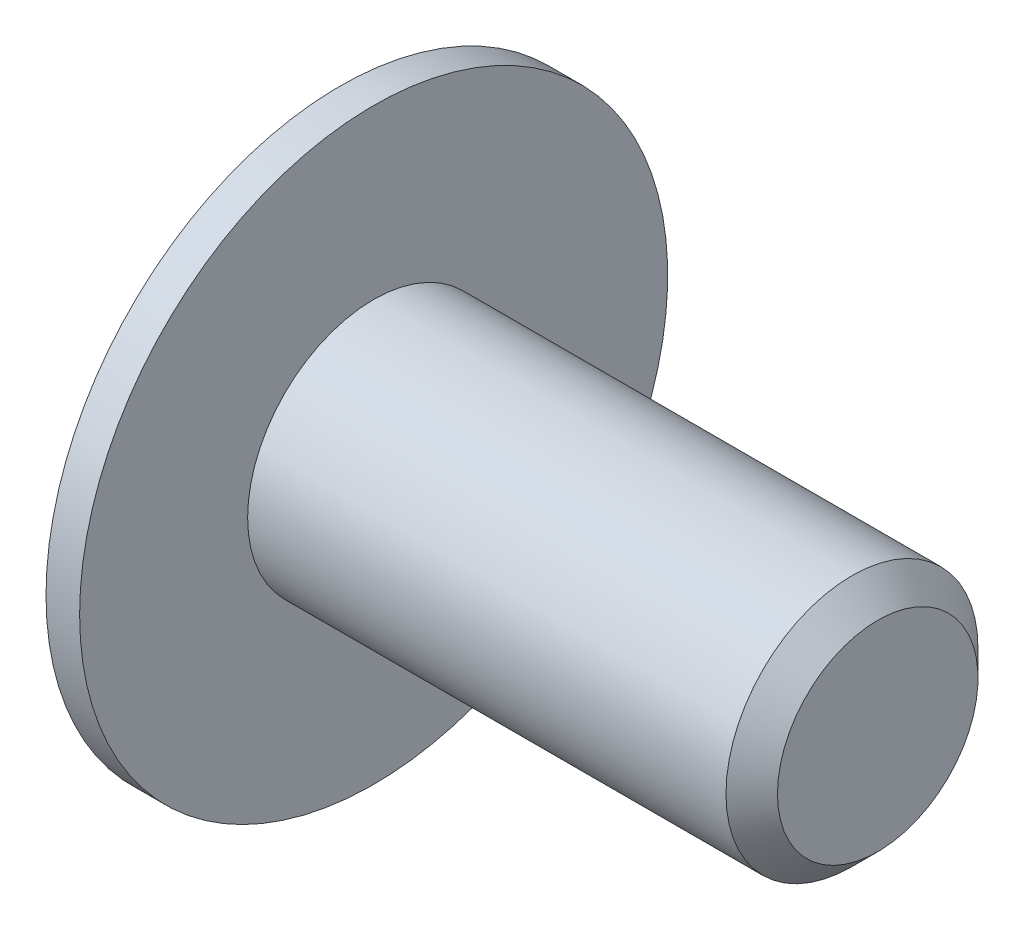
ISO-10303-21;
HEADER;
FILE_DESCRIPTION(('STEP AP214'),'2;1');
FILE_NAME('part.step','',(''),(''),'','','');
FILE_SCHEMA(('AUTOMOTIVE_DESIGN { 1 0 10303 214 1 1 1 1 }'));
ENDSEC;
DATA;
#1=APPLICATION_CONTEXT('core data for automotive mechanical design processes');
#2=APPLICATION_PROTOCOL_DEFINITION('international standard','automotive_design',2000,#1);
#3=PRODUCT_CONTEXT('',#1,'mechanical');
#4=PRODUCT('Part','Part','',(#3));
#5=PRODUCT_RELATED_PRODUCT_CATEGORY('part','',(#4));
#6=PRODUCT_DEFINITION_FORMATION('','',#4);
#7=PRODUCT_DEFINITION_CONTEXT('part definition',#1,'design');
#8=PRODUCT_DEFINITION('design','',#6,#7);
#9=PRODUCT_DEFINITION_SHAPE('','',#8);
#10=(LENGTH_UNIT() NAMED_UNIT(*) SI_UNIT(.MILLI.,.METRE.));
#11=(NAMED_UNIT(*) PLANE_ANGLE_UNIT() SI_UNIT($,.RADIAN.));
#12=(NAMED_UNIT(*) SI_UNIT($,.STERADIAN.) SOLID_ANGLE_UNIT());
#13=UNCERTAINTY_MEASURE_WITH_UNIT(LENGTH_MEASURE(1.E-05),#10,'distance_accuracy_value','');
#14=(GEOMETRIC_REPRESENTATION_CONTEXT(3) GLOBAL_UNCERTAINTY_ASSIGNED_CONTEXT((#13)) GLOBAL_UNIT_ASSIGNED_CONTEXT((#10,
#11,#12)) REPRESENTATION_CONTEXT('',''));
#15=CARTESIAN_POINT('',(0.,0.,0.));
#16=DIRECTION('',(0.,0.,1.));
#17=DIRECTION('',(1.,0.,0.));
#18=AXIS2_PLACEMENT_3D('',#15,#16,#17);
#19=CARTESIAN_POINT('',(-0.8,0.,0.));
#20=DIRECTION('',(1.,0.,0.));
#21=DIRECTION('',(0.,0.,-1.));
#22=AXIS2_PLACEMENT_3D('',#19,#20,#21);
#23=PLANE('',#22);
#24=CARTESIAN_POINT('',(-0.8,0.,0.));
#25=DIRECTION('',(-1.,0.,0.));
#26=DIRECTION('',(0.,0.,1.));
#27=AXIS2_PLACEMENT_3D('',#24,#25,#26);
#28=CIRCLE('',#27,2.8);
#29=CARTESIAN_POINT('',(-0.8,0.,2.8));
#30=VERTEX_POINT('',#29);
#31=EDGE_CURVE('E11',#30,#30,#28,.T.);
#32=ORIENTED_EDGE('',*,*,#31,.T.);
#33=EDGE_LOOP('',(#32));
#34=FACE_BOUND('',#33,.T.);
#35=DIRECTION('',(0.,0.,1.));
#36=VECTOR('',#35,1.);
#37=CARTESIAN_POINT('',(-0.8,0.23333335666667,0.46666669));
#38=LINE('',#37,#36);
#39=CARTESIAN_POINT('',(-0.8,0.23333335666667,0.46666669));
#40=VERTEX_POINT('',#39);
#41=CARTESIAN_POINT('',(-0.8,0.23333335666667,1.1666666666667));
#42=VERTEX_POINT('',#41);
#43=EDGE_CURVE('E51',#40,#42,#38,.T.);
#44=ORIENTED_EDGE('',*,*,#43,.T.);
#45=DIRECTION('',(0.,-1.,0.));
#46=VECTOR('',#45,1.);
#47=CARTESIAN_POINT('',(-0.8,0.23333335666667,1.1666666666667));
#48=LINE('',#47,#46);
#49=CARTESIAN_POINT('',(-0.8,-0.23333333333333,1.1666666666667));
#50=VERTEX_POINT('',#49);
#51=EDGE_CURVE('E183',#42,#50,#48,.T.);
#52=ORIENTED_EDGE('',*,*,#51,.T.);
#53=DIRECTION('',(0.,0.,-1.));
#54=VECTOR('',#53,1.);
#55=CARTESIAN_POINT('',(-0.8,-0.23333333333333,1.1666666666667));
#56=LINE('',#55,#54);
#57=CARTESIAN_POINT('',(-0.8,-0.23333333333333,0.46666669));
#58=VERTEX_POINT('',#57);
#59=EDGE_CURVE('E186',#50,#58,#56,.T.);
#60=ORIENTED_EDGE('',*,*,#59,.T.);
#61=CARTESIAN_POINT('',(-0.8,-0.466666666666673,0.466666690000013));
#62=DIRECTION('',(-1.,0.,0.));
#63=DIRECTION('',(0.,0.,1.));
#64=AXIS2_PLACEMENT_3D('',#61,#62,#63);
#65=CIRCLE('',#64,0.233333333333343);
#66=CARTESIAN_POINT('',(-0.8,-0.46666666666667,0.23333335666667));
#67=VERTEX_POINT('',#66);
#68=EDGE_CURVE('E189',#58,#67,#65,.T.);
#69=ORIENTED_EDGE('',*,*,#68,.T.);
#70=DIRECTION('',(0.,-1.,0.));
#71=VECTOR('',#70,1.);
#72=CARTESIAN_POINT('',(-0.8,-0.46666666666667,0.23333335666667));
#73=LINE('',#72,#71);
#74=CARTESIAN_POINT('',(-0.8,-1.1666666666667,0.23333335666667));
#75=VERTEX_POINT('',#74);
#76=EDGE_CURVE('E192',#67,#75,#73,.T.);
#77=ORIENTED_EDGE('',*,*,#76,.T.);
#78=DIRECTION('',(0.,0.,-1.));
#79=VECTOR('',#78,1.);
#80=CARTESIAN_POINT('',(-0.8,-1.1666666666667,0.23333335666667));
#81=LINE('',#80,#79);
#82=CARTESIAN_POINT('',(-0.8,-1.1666666666667,-0.23333333333333));
#83=VERTEX_POINT('',#82);
#84=EDGE_CURVE('E195',#75,#83,#81,.T.);
#85=ORIENTED_EDGE('',*,*,#84,.T.);
#86=DIRECTION('',(0.,1.,0.));
#87=VECTOR('',#86,1.);
#88=CARTESIAN_POINT('',(-0.8,-1.1666666666667,-0.23333333333333));
#89=LINE('',#88,#87);
#90=CARTESIAN_POINT('',(-0.8,-0.46666666666667,-0.23333333333333));
#91=VERTEX_POINT('',#90);
#92=EDGE_CURVE('E198',#83,#91,#89,.T.);
#93=ORIENTED_EDGE('',*,*,#92,.T.);
#94=CARTESIAN_POINT('',(-0.8,-0.46666666666669,-0.46666666666669));
#95=DIRECTION('',(-1.,0.,0.));
#96=DIRECTION('',(0.,0.,1.));
#97=AXIS2_PLACEMENT_3D('',#94,#95,#96);
#98=CIRCLE('',#97,0.23333333333336);
#99=CARTESIAN_POINT('',(-0.8,-0.23333333333333,-0.46666666666667));
#100=VERTEX_POINT('',#99);
#101=EDGE_CURVE('E201',#91,#100,#98,.T.);
#102=ORIENTED_EDGE('',*,*,#101,.T.);
#103=DIRECTION('',(0.,0.,-1.));
#104=VECTOR('',#103,1.);
#105=CARTESIAN_POINT('',(-0.8,-0.23333333333333,-0.46666666666667));
#106=LINE('',#105,#104);
#107=CARTESIAN_POINT('',(-0.8,-0.23333333333333,-1.1666666666667));
#108=VERTEX_POINT('',#107);
#109=EDGE_CURVE('E204',#100,#108,#106,.T.);
#110=ORIENTED_EDGE('',*,*,#109,.T.);
#111=DIRECTION('',(0.,1.,0.));
#112=VECTOR('',#111,1.);
#113=CARTESIAN_POINT('',(-0.8,-0.23333333333333,-1.1666666666667));
#114=LINE('',#113,#112);
#115=CARTESIAN_POINT('',(-0.8,0.23333335666667,-1.1666666666667));
#116=VERTEX_POINT('',#115);
#117=EDGE_CURVE('E207',#108,#116,#114,.T.);
#118=ORIENTED_EDGE('',*,*,#117,.T.);
#119=DIRECTION('',(0.,0.,1.));
#120=VECTOR('',#119,1.);
#121=CARTESIAN_POINT('',(-0.8,0.23333335666667,-1.1666666666667));
#122=LINE('',#121,#120);
#123=CARTESIAN_POINT('',(-0.8,0.23333335666667,-0.46666666666667));
#124=VERTEX_POINT('',#123);
#125=EDGE_CURVE('E210',#116,#124,#122,.T.);
#126=ORIENTED_EDGE('',*,*,#125,.T.);
#127=CARTESIAN_POINT('',(-0.8,0.466666690000013,-0.466666666666673));
#128=DIRECTION('',(-1.,0.,0.));
#129=DIRECTION('',(0.,0.,1.));
#130=AXIS2_PLACEMENT_3D('',#127,#128,#129);
#131=CIRCLE('',#130,0.233333333333343);
#132=CARTESIAN_POINT('',(-0.8,0.466666690000013,-0.23333333333333));
#133=VERTEX_POINT('',#132);
#134=EDGE_CURVE('E213',#124,#133,#131,.T.);
#135=ORIENTED_EDGE('',*,*,#134,.T.);
#136=DIRECTION('',(0.,1.,0.));
#137=VECTOR('',#136,1.);
#138=CARTESIAN_POINT('',(-0.8,0.46666669,-0.23333333333333));
#139=LINE('',#138,#137);
#140=CARTESIAN_POINT('',(-0.8,1.1666666666667,-0.23333333333333));
#141=VERTEX_POINT('',#140);
#142=EDGE_CURVE('E216',#133,#141,#139,.T.);
#143=ORIENTED_EDGE('',*,*,#142,.T.);
#144=DIRECTION('',(0.,0.,1.));
#145=VECTOR('',#144,1.);
#146=CARTESIAN_POINT('',(-0.8,1.1666666666667,-0.23333333333333));
#147=LINE('',#146,#145);
#148=CARTESIAN_POINT('',(-0.8,1.1666666666667,0.23333335666667));
#149=VERTEX_POINT('',#148);
#150=EDGE_CURVE('E219',#141,#149,#147,.T.);
#151=ORIENTED_EDGE('',*,*,#150,.T.);
#152=DIRECTION('',(0.,-1.,0.));
#153=VECTOR('',#152,1.);
#154=CARTESIAN_POINT('',(-0.8,1.1666666666667,0.23333335666667));
#155=LINE('',#154,#153);
#156=CARTESIAN_POINT('',(-0.8,0.46666669,0.23333335666667));
#157=VERTEX_POINT('',#156);
#158=EDGE_CURVE('E173',#149,#157,#155,.T.);
#159=ORIENTED_EDGE('',*,*,#158,.T.);
#160=CARTESIAN_POINT('',(-0.8,0.466666689999996,0.466666689999996));
#161=DIRECTION('',(-1.,0.,0.));
#162=DIRECTION('',(0.,0.,1.));
#163=AXIS2_PLACEMENT_3D('',#160,#161,#162);
#164=CIRCLE('',#163,0.233333333333326);
#165=EDGE_CURVE('E222',#157,#40,#164,.T.);
#166=ORIENTED_EDGE('',*,*,#165,.T.);
#167=EDGE_LOOP('',(#44,#52,#60,#69,#77,#85,#93,#102,#110,#118,#126,#135,#143,#151,#159,#166));
#168=FACE_BOUND('',#167,.T.);
#169=ADVANCED_FACE('F37',(#34,#168),#23,.F.);
#170=CARTESIAN_POINT('',(-0.4,0.,0.));
#171=DIRECTION('',(1.,0.,0.));
#172=DIRECTION('',(0.,0.,-1.));
#173=AXIS2_PLACEMENT_3D('',#170,#171,#172);
#174=CONICAL_SURFACE('',#173,3.5,1.05165021254837);
#175=ORIENTED_EDGE('',*,*,#31,.F.);
#176=EDGE_LOOP('',(#175));
#177=FACE_BOUND('',#176,.T.);
#178=CARTESIAN_POINT('',(-0.4,0.,0.));
#179=DIRECTION('',(-1.,0.,0.));
#180=DIRECTION('',(0.,0.,1.));
#181=AXIS2_PLACEMENT_3D('',#178,#179,#180);
#182=CIRCLE('',#181,3.5);
#183=CARTESIAN_POINT('',(-0.4,0.,3.5));
#184=VERTEX_POINT('',#183);
#185=EDGE_CURVE('E44',#184,#184,#182,.T.);
#186=ORIENTED_EDGE('',*,*,#185,.T.);
#187=EDGE_LOOP('',(#186));
#188=FACE_BOUND('',#187,.T.);
#189=ADVANCED_FACE('F267',(#177,#188),#174,.T.);
#190=CARTESIAN_POINT('',(6.,0.,0.));
#191=DIRECTION('',(-1.,0.,0.));
#192=DIRECTION('',(0.,0.,1.));
#193=AXIS2_PLACEMENT_3D('',#190,#191,#192);
#194=CYLINDRICAL_SURFACE('',#193,3.5);
#195=ORIENTED_EDGE('',*,*,#185,.F.);
#196=EDGE_LOOP('',(#195));
#197=FACE_BOUND('',#196,.T.);
#198=CARTESIAN_POINT('',(0.,0.,0.));
#199=DIRECTION('',(-1.,0.,0.));
#200=DIRECTION('',(0.,0.,1.));
#201=AXIS2_PLACEMENT_3D('',#198,#199,#200);
#202=CIRCLE('',#201,3.5);
#203=CARTESIAN_POINT('',(0.,0.,3.5));
#204=VERTEX_POINT('',#203);
#205=EDGE_CURVE('E262',#204,#204,#202,.T.);
#206=ORIENTED_EDGE('',*,*,#205,.T.);
#207=EDGE_LOOP('',(#206));
#208=FACE_BOUND('',#207,.T.);
#209=ADVANCED_FACE('F269',(#197,#208),#194,.T.);
#210=CARTESIAN_POINT('',(0.,3.5,0.));
#211=DIRECTION('',(-1.,0.,0.));
#212=DIRECTION('',(0.,0.,1.));
#213=AXIS2_PLACEMENT_3D('',#210,#211,#212);
#214=PLANE('',#213);
#215=ORIENTED_EDGE('',*,*,#205,.F.);
#216=EDGE_LOOP('',(#215));
#217=FACE_BOUND('',#216,.T.);
#218=CARTESIAN_POINT('',(0.,0.,0.));
#219=DIRECTION('',(-1.,0.,0.));
#220=DIRECTION('',(0.,0.,1.));
#221=AXIS2_PLACEMENT_3D('',#218,#219,#220);
#222=CIRCLE('',#221,1.5);
#223=CARTESIAN_POINT('',(0.,0.,1.5));
#224=VERTEX_POINT('',#223);
#225=EDGE_CURVE('E259',#224,#224,#222,.T.);
#226=ORIENTED_EDGE('',*,*,#225,.T.);
#227=EDGE_LOOP('',(#226));
#228=FACE_BOUND('',#227,.T.);
#229=ADVANCED_FACE('F272',(#217,#228),#214,.F.);
#230=CARTESIAN_POINT('',(6.,0.,0.));
#231=DIRECTION('',(-1.,0.,0.));
#232=DIRECTION('',(0.,0.,1.));
#233=AXIS2_PLACEMENT_3D('',#230,#231,#232);
#234=CYLINDRICAL_SURFACE('',#233,1.5);
#235=ORIENTED_EDGE('',*,*,#225,.F.);
#236=EDGE_LOOP('',(#235));
#237=FACE_BOUND('',#236,.T.);
#238=CARTESIAN_POINT('',(5.6935,0.,0.));
#239=DIRECTION('',(-1.,0.,0.));
#240=DIRECTION('',(0.,0.,1.));
#241=AXIS2_PLACEMENT_3D('',#238,#239,#240);
#242=CIRCLE('',#241,1.5);
#243=CARTESIAN_POINT('',(5.6935,0.,1.5));
#244=VERTEX_POINT('',#243);
#245=EDGE_CURVE('E256',#244,#244,#242,.T.);
#246=ORIENTED_EDGE('',*,*,#245,.T.);
#247=EDGE_LOOP('',(#246));
#248=FACE_BOUND('',#247,.T.);
#249=ADVANCED_FACE('F278',(#237,#248),#234,.T.);
#250=CARTESIAN_POINT('',(6.,0.,0.));
#251=DIRECTION('',(-1.,0.,0.));
#252=DIRECTION('',(0.,0.,1.));
#253=AXIS2_PLACEMENT_3D('',#250,#251,#252);
#254=CONICAL_SURFACE('',#253,1.1935,0.785398163397448);
#255=ORIENTED_EDGE('',*,*,#245,.F.);
#256=EDGE_LOOP('',(#255));
#257=FACE_BOUND('',#256,.T.);
#258=CARTESIAN_POINT('',(6.,0.,0.));
#259=DIRECTION('',(-1.,0.,0.));
#260=DIRECTION('',(0.,0.,1.));
#261=AXIS2_PLACEMENT_3D('',#258,#259,#260);
#262=CIRCLE('',#261,1.1935);
#263=CARTESIAN_POINT('',(6.,0.,1.1935));
#264=VERTEX_POINT('',#263);
#265=EDGE_CURVE('E253',#264,#264,#262,.T.);
#266=ORIENTED_EDGE('',*,*,#265,.T.);
#267=EDGE_LOOP('',(#266));
#268=FACE_BOUND('',#267,.T.);
#269=ADVANCED_FACE('F284',(#257,#268),#254,.T.);
#270=CARTESIAN_POINT('',(6.,1.1935,0.));
#271=DIRECTION('',(-1.,0.,0.));
#272=DIRECTION('',(0.,0.,1.));
#273=AXIS2_PLACEMENT_3D('',#270,#271,#272);
#274=PLANE('',#273);
#275=ORIENTED_EDGE('',*,*,#265,.F.);
#276=EDGE_LOOP('',(#275));
#277=FACE_BOUND('',#276,.T.);
#278=ADVANCED_FACE('F290',(#277),#274,.F.);
#279=CARTESIAN_POINT('',(-0.4,0.23333335666667,0.46666669));
#280=DIRECTION('',(0.,-1.,0.));
#281=DIRECTION('',(0.,0.,-1.));
#282=AXIS2_PLACEMENT_3D('',#279,#280,#281);
#283=PLANE('',#282);
#284=ORIENTED_EDGE('',*,*,#43,.F.);
#285=DIRECTION('',(-1.,0.,0.));
#286=VECTOR('',#285,1.);
#287=CARTESIAN_POINT('',(-0.4,0.23333335666667,0.46666669));
#288=LINE('',#287,#286);
#289=CARTESIAN_POINT('',(-0.4,0.23333335666667,0.46666669));
#290=VERTEX_POINT('',#289);
#291=EDGE_CURVE('E178',#290,#40,#288,.T.);
#292=ORIENTED_EDGE('',*,*,#291,.F.);
#293=DIRECTION('',(0.,0.,1.));
#294=VECTOR('',#293,1.);
#295=CARTESIAN_POINT('',(-0.4,0.23333335666667,0.46666669));
#296=LINE('',#295,#294);
#297=CARTESIAN_POINT('',(-0.4,0.23333335666667,1.1666666666667));
#298=VERTEX_POINT('',#297);
#299=EDGE_CURVE('E225',#290,#298,#296,.T.);
#300=ORIENTED_EDGE('',*,*,#299,.T.);
#301=DIRECTION('',(-1.,0.,0.));
#302=VECTOR('',#301,1.);
#303=CARTESIAN_POINT('',(-0.4,0.23333335666667,1.1666666666667));
#304=LINE('',#303,#302);
#305=EDGE_CURVE('E251',#298,#42,#304,.T.);
#306=ORIENTED_EDGE('',*,*,#305,.T.);
#307=EDGE_LOOP('',(#284,#292,#300,#306));
#308=FACE_BOUND('',#307,.T.);
#309=ADVANCED_FACE('F295',(#308),#283,.T.);
#310=CARTESIAN_POINT('',(-0.4,0.23333335666667,1.1666666666667));
#311=DIRECTION('',(0.,0.,-1.));
#312=DIRECTION('',(-1.,0.,0.));
#313=AXIS2_PLACEMENT_3D('',#310,#311,#312);
#314=PLANE('',#313);
#315=ORIENTED_EDGE('',*,*,#51,.F.);
#316=ORIENTED_EDGE('',*,*,#305,.F.);
#317=DIRECTION('',(0.,-1.,0.));
#318=VECTOR('',#317,1.);
#319=CARTESIAN_POINT('',(-0.4,0.23333335666667,1.1666666666667));
#320=LINE('',#319,#318);
#321=CARTESIAN_POINT('',(-0.4,-0.23333333333333,1.1666666666667));
#322=VERTEX_POINT('',#321);
#323=EDGE_CURVE('E120',#298,#322,#320,.T.);
#324=ORIENTED_EDGE('',*,*,#323,.T.);
#325=DIRECTION('',(-1.,0.,0.));
#326=VECTOR('',#325,1.);
#327=CARTESIAN_POINT('',(-0.4,-0.23333333333333,1.1666666666667));
#328=LINE('',#327,#326);
#329=EDGE_CURVE('E249',#322,#50,#328,.T.);
#330=ORIENTED_EDGE('',*,*,#329,.T.);
#331=EDGE_LOOP('',(#315,#316,#324,#330));
#332=FACE_BOUND('',#331,.T.);
#333=ADVANCED_FACE('F300',(#332),#314,.T.);
#334=CARTESIAN_POINT('',(-0.4,-0.23333333333333,1.1666666666667));
#335=DIRECTION('',(0.,1.,0.));
#336=DIRECTION('',(0.,0.,1.));
#337=AXIS2_PLACEMENT_3D('',#334,#335,#336);
#338=PLANE('',#337);
#339=ORIENTED_EDGE('',*,*,#59,.F.);
#340=ORIENTED_EDGE('',*,*,#329,.F.);
#341=DIRECTION('',(0.,0.,-1.));
#342=VECTOR('',#341,1.);
#343=CARTESIAN_POINT('',(-0.4,-0.23333333333333,1.1666666666667));
#344=LINE('',#343,#342);
#345=CARTESIAN_POINT('',(-0.4,-0.23333333333333,0.46666669));
#346=VERTEX_POINT('',#345);
#347=EDGE_CURVE('E313',#322,#346,#344,.T.);
#348=ORIENTED_EDGE('',*,*,#347,.T.);
#349=DIRECTION('',(-1.,0.,0.));
#350=VECTOR('',#349,1.);
#351=CARTESIAN_POINT('',(-0.4,-0.23333333333333,0.46666669));
#352=LINE('',#351,#350);
#353=EDGE_CURVE('E247',#346,#58,#352,.T.);
#354=ORIENTED_EDGE('',*,*,#353,.T.);
#355=EDGE_LOOP('',(#339,#340,#348,#354));
#356=FACE_BOUND('',#355,.T.);
#357=ADVANCED_FACE('F386',(#356),#338,.T.);
#358=CARTESIAN_POINT('',(-0.4,-0.466666666666673,0.466666690000013));
#359=DIRECTION('',(-1.,0.,0.));
#360=DIRECTION('',(0.,0.,1.));
#361=AXIS2_PLACEMENT_3D('',#358,#359,#360);
#362=CYLINDRICAL_SURFACE('',#361,0.233333333333343);
#363=ORIENTED_EDGE('',*,*,#68,.F.);
#364=ORIENTED_EDGE('',*,*,#353,.F.);
#365=CARTESIAN_POINT('',(-0.4,-0.466666666666673,0.466666690000013));
#366=DIRECTION('',(-1.,0.,0.));
#367=DIRECTION('',(0.,0.,1.));
#368=AXIS2_PLACEMENT_3D('',#365,#366,#367);
#369=CIRCLE('',#368,0.233333333333343);
#370=CARTESIAN_POINT('',(-0.4,-0.46666666666667,0.23333335666667));
#371=VERTEX_POINT('',#370);
#372=EDGE_CURVE('E317',#346,#371,#369,.T.);
#373=ORIENTED_EDGE('',*,*,#372,.T.);
#374=DIRECTION('',(-1.,0.,0.));
#375=VECTOR('',#374,1.);
#376=CARTESIAN_POINT('',(-0.4,-0.46666666666667,0.23333335666667));
#377=LINE('',#376,#375);
#378=EDGE_CURVE('E245',#371,#67,#377,.T.);
#379=ORIENTED_EDGE('',*,*,#378,.T.);
#380=EDGE_LOOP('',(#363,#364,#373,#379));
#381=FACE_BOUND('',#380,.T.);
#382=ADVANCED_FACE('F381',(#381),#362,.T.);
#383=CARTESIAN_POINT('',(-0.4,-0.46666666666667,0.23333335666667));
#384=DIRECTION('',(0.,0.,-1.));
#385=DIRECTION('',(-1.,0.,0.));
#386=AXIS2_PLACEMENT_3D('',#383,#384,#385);
#387=PLANE('',#386);
#388=ORIENTED_EDGE('',*,*,#76,.F.);
#389=ORIENTED_EDGE('',*,*,#378,.F.);
#390=DIRECTION('',(0.,-1.,0.));
#391=VECTOR('',#390,1.);
#392=CARTESIAN_POINT('',(-0.4,-0.46666666666667,0.23333335666667));
#393=LINE('',#392,#391);
#394=CARTESIAN_POINT('',(-0.4,-1.1666666666667,0.23333335666667));
#395=VERTEX_POINT('',#394);
#396=EDGE_CURVE('E319',#371,#395,#393,.T.);
#397=ORIENTED_EDGE('',*,*,#396,.T.);
#398=DIRECTION('',(-1.,0.,0.));
#399=VECTOR('',#398,1.);
#400=CARTESIAN_POINT('',(-0.4,-1.1666666666667,0.23333335666667));
#401=LINE('',#400,#399);
#402=EDGE_CURVE('E243',#395,#75,#401,.T.);
#403=ORIENTED_EDGE('',*,*,#402,.T.);
#404=EDGE_LOOP('',(#388,#389,#397,#403));
#405=FACE_BOUND('',#404,.T.);
#406=ADVANCED_FACE('F377',(#405),#387,.T.);
#407=CARTESIAN_POINT('',(-0.4,-1.1666666666667,0.23333335666667));
#408=DIRECTION('',(0.,1.,0.));
#409=DIRECTION('',(0.,0.,1.));
#410=AXIS2_PLACEMENT_3D('',#407,#408,#409);
#411=PLANE('',#410);
#412=ORIENTED_EDGE('',*,*,#84,.F.);
#413=ORIENTED_EDGE('',*,*,#402,.F.);
#414=DIRECTION('',(0.,0.,-1.));
#415=VECTOR('',#414,1.);
#416=CARTESIAN_POINT('',(-0.4,-1.1666666666667,0.23333335666667));
#417=LINE('',#416,#415);
#418=CARTESIAN_POINT('',(-0.4,-1.1666666666667,-0.23333333333333));
#419=VERTEX_POINT('',#418);
#420=EDGE_CURVE('E321',#395,#419,#417,.T.);
#421=ORIENTED_EDGE('',*,*,#420,.T.);
#422=DIRECTION('',(-1.,0.,0.));
#423=VECTOR('',#422,1.);
#424=CARTESIAN_POINT('',(-0.4,-1.1666666666667,-0.23333333333333));
#425=LINE('',#424,#423);
#426=EDGE_CURVE('E241',#419,#83,#425,.T.);
#427=ORIENTED_EDGE('',*,*,#426,.T.);
#428=EDGE_LOOP('',(#412,#413,#421,#427));
#429=FACE_BOUND('',#428,.T.);
#430=ADVANCED_FACE('F374',(#429),#411,.T.);
#431=CARTESIAN_POINT('',(-0.4,-1.1666666666667,-0.23333333333333));
#432=DIRECTION('',(0.,0.,1.));
#433=DIRECTION('',(1.,0.,0.));
#434=AXIS2_PLACEMENT_3D('',#431,#432,#433);
#435=PLANE('',#434);
#436=ORIENTED_EDGE('',*,*,#92,.F.);
#437=ORIENTED_EDGE('',*,*,#426,.F.);
#438=DIRECTION('',(0.,1.,0.));
#439=VECTOR('',#438,1.);
#440=CARTESIAN_POINT('',(-0.4,-1.1666666666667,-0.23333333333333));
#441=LINE('',#440,#439);
#442=CARTESIAN_POINT('',(-0.4,-0.46666666666667,-0.23333333333333));
#443=VERTEX_POINT('',#442);
#444=EDGE_CURVE('E323',#419,#443,#441,.T.);
#445=ORIENTED_EDGE('',*,*,#444,.T.);
#446=DIRECTION('',(-1.,0.,0.));
#447=VECTOR('',#446,1.);
#448=CARTESIAN_POINT('',(-0.4,-0.46666666666667,-0.23333333333333));
#449=LINE('',#448,#447);
#450=EDGE_CURVE('E239',#443,#91,#449,.T.);
#451=ORIENTED_EDGE('',*,*,#450,.T.);
#452=EDGE_LOOP('',(#436,#437,#445,#451));
#453=FACE_BOUND('',#452,.T.);
#454=ADVANCED_FACE('F366',(#453),#435,.T.);
#455=CARTESIAN_POINT('',(-0.4,-0.46666666666669,-0.46666666666669));
#456=DIRECTION('',(-1.,0.,0.));
#457=DIRECTION('',(0.,0.,1.));
#458=AXIS2_PLACEMENT_3D('',#455,#456,#457);
#459=CYLINDRICAL_SURFACE('',#458,0.23333333333336);
#460=ORIENTED_EDGE('',*,*,#101,.F.);
#461=ORIENTED_EDGE('',*,*,#450,.F.);
#462=CARTESIAN_POINT('',(-0.4,-0.46666666666669,-0.46666666666669));
#463=DIRECTION('',(-1.,0.,0.));
#464=DIRECTION('',(0.,0.,1.));
#465=AXIS2_PLACEMENT_3D('',#462,#463,#464);
#466=CIRCLE('',#465,0.23333333333336);
#467=CARTESIAN_POINT('',(-0.4,-0.23333333333333,-0.46666666666667));
#468=VERTEX_POINT('',#467);
#469=EDGE_CURVE('E325',#443,#468,#466,.T.);
#470=ORIENTED_EDGE('',*,*,#469,.T.);
#471=DIRECTION('',(-1.,0.,0.));
#472=VECTOR('',#471,1.);
#473=CARTESIAN_POINT('',(-0.4,-0.23333333333333,-0.46666666666667));
#474=LINE('',#473,#472);
#475=EDGE_CURVE('E237',#468,#100,#474,.T.);
#476=ORIENTED_EDGE('',*,*,#475,.T.);
#477=EDGE_LOOP('',(#460,#461,#470,#476));
#478=FACE_BOUND('',#477,.T.);
#479=ADVANCED_FACE('F362',(#478),#459,.T.);
#480=CARTESIAN_POINT('',(-0.4,-0.23333333333333,-0.46666666666667));
#481=DIRECTION('',(0.,1.,0.));
#482=DIRECTION('',(0.,0.,1.));
#483=AXIS2_PLACEMENT_3D('',#480,#481,#482);
#484=PLANE('',#483);
#485=ORIENTED_EDGE('',*,*,#109,.F.);
#486=ORIENTED_EDGE('',*,*,#475,.F.);
#487=DIRECTION('',(0.,0.,-1.));
#488=VECTOR('',#487,1.);
#489=CARTESIAN_POINT('',(-0.4,-0.23333333333333,-0.46666666666667));
#490=LINE('',#489,#488);
#491=CARTESIAN_POINT('',(-0.4,-0.23333333333333,-1.1666666666667));
#492=VERTEX_POINT('',#491);
#493=EDGE_CURVE('E327',#468,#492,#490,.T.);
#494=ORIENTED_EDGE('',*,*,#493,.T.);
#495=DIRECTION('',(-1.,0.,0.));
#496=VECTOR('',#495,1.);
#497=CARTESIAN_POINT('',(-0.4,-0.23333333333333,-1.1666666666667));
#498=LINE('',#497,#496);
#499=EDGE_CURVE('E235',#492,#108,#498,.T.);
#500=ORIENTED_EDGE('',*,*,#499,.T.);
#501=EDGE_LOOP('',(#485,#486,#494,#500));
#502=FACE_BOUND('',#501,.T.);
#503=ADVANCED_FACE('F359',(#502),#484,.T.);
#504=CARTESIAN_POINT('',(-0.4,-0.23333333333333,-1.1666666666667));
#505=DIRECTION('',(0.,0.,1.));
#506=DIRECTION('',(1.,0.,0.));
#507=AXIS2_PLACEMENT_3D('',#504,#505,#506);
#508=PLANE('',#507);
#509=ORIENTED_EDGE('',*,*,#117,.F.);
#510=ORIENTED_EDGE('',*,*,#499,.F.);
#511=DIRECTION('',(0.,1.,0.));
#512=VECTOR('',#511,1.);
#513=CARTESIAN_POINT('',(-0.4,-0.23333333333333,-1.1666666666667));
#514=LINE('',#513,#512);
#515=CARTESIAN_POINT('',(-0.4,0.23333335666667,-1.1666666666667));
#516=VERTEX_POINT('',#515);
#517=EDGE_CURVE('E329',#492,#516,#514,.T.);
#518=ORIENTED_EDGE('',*,*,#517,.T.);
#519=DIRECTION('',(-1.,0.,0.));
#520=VECTOR('',#519,1.);
#521=CARTESIAN_POINT('',(-0.4,0.23333335666667,-1.1666666666667));
#522=LINE('',#521,#520);
#523=EDGE_CURVE('E233',#516,#116,#522,.T.);
#524=ORIENTED_EDGE('',*,*,#523,.T.);
#525=EDGE_LOOP('',(#509,#510,#518,#524));
#526=FACE_BOUND('',#525,.T.);
#527=ADVANCED_FACE('F351',(#526),#508,.T.);
#528=CARTESIAN_POINT('',(-0.4,0.23333335666667,-1.1666666666667));
#529=DIRECTION('',(0.,-1.,0.));
#530=DIRECTION('',(0.,0.,-1.));
#531=AXIS2_PLACEMENT_3D('',#528,#529,#530);
#532=PLANE('',#531);
#533=ORIENTED_EDGE('',*,*,#125,.F.);
#534=ORIENTED_EDGE('',*,*,#523,.F.);
#535=DIRECTION('',(0.,0.,1.));
#536=VECTOR('',#535,1.);
#537=CARTESIAN_POINT('',(-0.4,0.23333335666667,-1.1666666666667));
#538=LINE('',#537,#536);
#539=CARTESIAN_POINT('',(-0.4,0.23333335666667,-0.46666666666667));
#540=VERTEX_POINT('',#539);
#541=EDGE_CURVE('E331',#516,#540,#538,.T.);
#542=ORIENTED_EDGE('',*,*,#541,.T.);
#543=DIRECTION('',(-1.,0.,0.));
#544=VECTOR('',#543,1.);
#545=CARTESIAN_POINT('',(-0.4,0.23333335666667,-0.46666666666667));
#546=LINE('',#545,#544);
#547=EDGE_CURVE('E231',#540,#124,#546,.T.);
#548=ORIENTED_EDGE('',*,*,#547,.T.);
#549=EDGE_LOOP('',(#533,#534,#542,#548));
#550=FACE_BOUND('',#549,.T.);
#551=ADVANCED_FACE('F347',(#550),#532,.T.);
#552=CARTESIAN_POINT('',(-0.4,0.466666690000013,-0.466666666666673));
#553=DIRECTION('',(-1.,0.,0.));
#554=DIRECTION('',(0.,0.,1.));
#555=AXIS2_PLACEMENT_3D('',#552,#553,#554);
#556=CYLINDRICAL_SURFACE('',#555,0.233333333333343);
#557=ORIENTED_EDGE('',*,*,#134,.F.);
#558=ORIENTED_EDGE('',*,*,#547,.F.);
#559=CARTESIAN_POINT('',(-0.4,0.466666690000013,-0.466666666666673));
#560=DIRECTION('',(-1.,0.,0.));
#561=DIRECTION('',(0.,0.,1.));
#562=AXIS2_PLACEMENT_3D('',#559,#560,#561);
#563=CIRCLE('',#562,0.233333333333343);
#564=CARTESIAN_POINT('',(-0.4,0.466666690000013,-0.23333333333333));
#565=VERTEX_POINT('',#564);
#566=EDGE_CURVE('E333',#540,#565,#563,.T.);
#567=ORIENTED_EDGE('',*,*,#566,.T.);
#568=DIRECTION('',(-1.,0.,0.));
#569=VECTOR('',#568,1.);
#570=CARTESIAN_POINT('',(-0.4,0.466666690000013,-0.23333333333333));
#571=LINE('',#570,#569);
#572=EDGE_CURVE('E229',#565,#133,#571,.T.);
#573=ORIENTED_EDGE('',*,*,#572,.T.);
#574=EDGE_LOOP('',(#557,#558,#567,#573));
#575=FACE_BOUND('',#574,.T.);
#576=ADVANCED_FACE('F344',(#575),#556,.T.);
#577=CARTESIAN_POINT('',(-0.4,0.46666669,-0.23333333333333));
#578=DIRECTION('',(0.,0.,1.));
#579=DIRECTION('',(1.,0.,0.));
#580=AXIS2_PLACEMENT_3D('',#577,#578,#579);
#581=PLANE('',#580);
#582=ORIENTED_EDGE('',*,*,#142,.F.);
#583=ORIENTED_EDGE('',*,*,#572,.F.);
#584=DIRECTION('',(0.,1.,0.));
#585=VECTOR('',#584,1.);
#586=CARTESIAN_POINT('',(-0.4,0.46666669,-0.23333333333333));
#587=LINE('',#586,#585);
#588=CARTESIAN_POINT('',(-0.4,1.1666666666667,-0.23333333333333));
#589=VERTEX_POINT('',#588);
#590=EDGE_CURVE('E169',#565,#589,#587,.T.);
#591=ORIENTED_EDGE('',*,*,#590,.T.);
#592=DIRECTION('',(-1.,0.,0.));
#593=VECTOR('',#592,1.);
#594=CARTESIAN_POINT('',(-0.4,1.1666666666667,-0.23333333333333));
#595=LINE('',#594,#593);
#596=EDGE_CURVE('E165',#589,#141,#595,.T.);
#597=ORIENTED_EDGE('',*,*,#596,.T.);
#598=EDGE_LOOP('',(#582,#583,#591,#597));
#599=FACE_BOUND('',#598,.T.);
#600=ADVANCED_FACE('F337',(#599),#581,.T.);
#601=CARTESIAN_POINT('',(-0.4,1.1666666666667,-0.23333333333333));
#602=DIRECTION('',(0.,-1.,0.));
#603=DIRECTION('',(0.,0.,-1.));
#604=AXIS2_PLACEMENT_3D('',#601,#602,#603);
#605=PLANE('',#604);
#606=ORIENTED_EDGE('',*,*,#150,.F.);
#607=ORIENTED_EDGE('',*,*,#596,.F.);
#608=DIRECTION('',(0.,0.,1.));
#609=VECTOR('',#608,1.);
#610=CARTESIAN_POINT('',(-0.4,1.1666666666667,-0.23333333333333));
#611=LINE('',#610,#609);
#612=CARTESIAN_POINT('',(-0.4,1.1666666666667,0.23333335666667));
#613=VERTEX_POINT('',#612);
#614=EDGE_CURVE('E160',#589,#613,#611,.T.);
#615=ORIENTED_EDGE('',*,*,#614,.T.);
#616=DIRECTION('',(-1.,0.,0.));
#617=VECTOR('',#616,1.);
#618=CARTESIAN_POINT('',(-0.4,1.1666666666667,0.23333335666667));
#619=LINE('',#618,#617);
#620=EDGE_CURVE('E164',#613,#149,#619,.T.);
#621=ORIENTED_EDGE('',*,*,#620,.T.);
#622=EDGE_LOOP('',(#606,#607,#615,#621));
#623=FACE_BOUND('',#622,.T.);
#624=ADVANCED_FACE('F163',(#623),#605,.T.);
#625=CARTESIAN_POINT('',(-0.4,1.1666666666667,0.23333335666667));
#626=DIRECTION('',(0.,0.,-1.));
#627=DIRECTION('',(-1.,0.,0.));
#628=AXIS2_PLACEMENT_3D('',#625,#626,#627);
#629=PLANE('',#628);
#630=ORIENTED_EDGE('',*,*,#158,.F.);
#631=ORIENTED_EDGE('',*,*,#620,.F.);
#632=DIRECTION('',(0.,-1.,0.));
#633=VECTOR('',#632,1.);
#634=CARTESIAN_POINT('',(-0.4,1.1666666666667,0.23333335666667));
#635=LINE('',#634,#633);
#636=CARTESIAN_POINT('',(-0.4,0.46666669,0.23333335666667));
#637=VERTEX_POINT('',#636);
#638=EDGE_CURVE('E168',#613,#637,#635,.T.);
#639=ORIENTED_EDGE('',*,*,#638,.T.);
#640=DIRECTION('',(-1.,0.,0.));
#641=VECTOR('',#640,1.);
#642=CARTESIAN_POINT('',(-0.4,0.46666669,0.23333335666667));
#643=LINE('',#642,#641);
#644=EDGE_CURVE('E111',#637,#157,#643,.T.);
#645=ORIENTED_EDGE('',*,*,#644,.T.);
#646=EDGE_LOOP('',(#630,#631,#639,#645));
#647=FACE_BOUND('',#646,.T.);
#648=ADVANCED_FACE('F171',(#647),#629,.T.);
#649=CARTESIAN_POINT('',(-0.4,0.466666689999996,0.466666689999996));
#650=DIRECTION('',(-1.,0.,0.));
#651=DIRECTION('',(0.,0.,1.));
#652=AXIS2_PLACEMENT_3D('',#649,#650,#651);
#653=CYLINDRICAL_SURFACE('',#652,0.233333333333326);
#654=ORIENTED_EDGE('',*,*,#165,.F.);
#655=ORIENTED_EDGE('',*,*,#644,.F.);
#656=CARTESIAN_POINT('',(-0.4,0.466666689999996,0.466666689999996));
#657=DIRECTION('',(-1.,0.,0.));
#658=DIRECTION('',(0.,0.,1.));
#659=AXIS2_PLACEMENT_3D('',#656,#657,#658);
#660=CIRCLE('',#659,0.233333333333326);
#661=EDGE_CURVE('E59',#637,#290,#660,.T.);
#662=ORIENTED_EDGE('',*,*,#661,.T.);
#663=ORIENTED_EDGE('',*,*,#291,.T.);
#664=EDGE_LOOP('',(#654,#655,#662,#663));
#665=FACE_BOUND('',#664,.T.);
#666=ADVANCED_FACE('F310',(#665),#653,.T.);
#667=CARTESIAN_POINT('',(-0.4,-0.466666666666673,0.466666690000013));
#668=DIRECTION('',(-1.,0.,0.));
#669=DIRECTION('',(0.,0.,1.));
#670=AXIS2_PLACEMENT_3D('',#667,#668,#669);
#671=PLANE('',#670);
#672=ORIENTED_EDGE('',*,*,#299,.F.);
#673=ORIENTED_EDGE('',*,*,#661,.F.);
#674=ORIENTED_EDGE('',*,*,#638,.F.);
#675=ORIENTED_EDGE('',*,*,#614,.F.);
#676=ORIENTED_EDGE('',*,*,#590,.F.);
#677=ORIENTED_EDGE('',*,*,#566,.F.);
#678=ORIENTED_EDGE('',*,*,#541,.F.);
#679=ORIENTED_EDGE('',*,*,#517,.F.);
#680=ORIENTED_EDGE('',*,*,#493,.F.);
#681=ORIENTED_EDGE('',*,*,#469,.F.);
#682=ORIENTED_EDGE('',*,*,#444,.F.);
#683=ORIENTED_EDGE('',*,*,#420,.F.);
#684=ORIENTED_EDGE('',*,*,#396,.F.);
#685=ORIENTED_EDGE('',*,*,#372,.F.);
#686=ORIENTED_EDGE('',*,*,#347,.F.);
#687=ORIENTED_EDGE('',*,*,#323,.F.);
#688=EDGE_LOOP('',(#672,#673,#674,#675,#676,#677,#678,#679,#680,#681,#682,#683,#684,#685,#686,#687));
#689=FACE_BOUND('',#688,.T.);
#690=ADVANCED_FACE('F176',(#689),#671,.T.);
#691=CLOSED_SHELL('',(#169,#189,#209,#229,#249,#269,#278,#309,#333,#357,#382,#406,#430,#454,
#479,#503,#527,#551,#576,#600,#624,#648,#666,#690));
#692=MANIFOLD_SOLID_BREP('B2',#691);
#693=ADVANCED_BREP_SHAPE_REPRESENTATION('',(#18,#692),#14);
#694=SHAPE_DEFINITION_REPRESENTATION(#9,#693);
ENDSEC;
END-ISO-10303-21;
